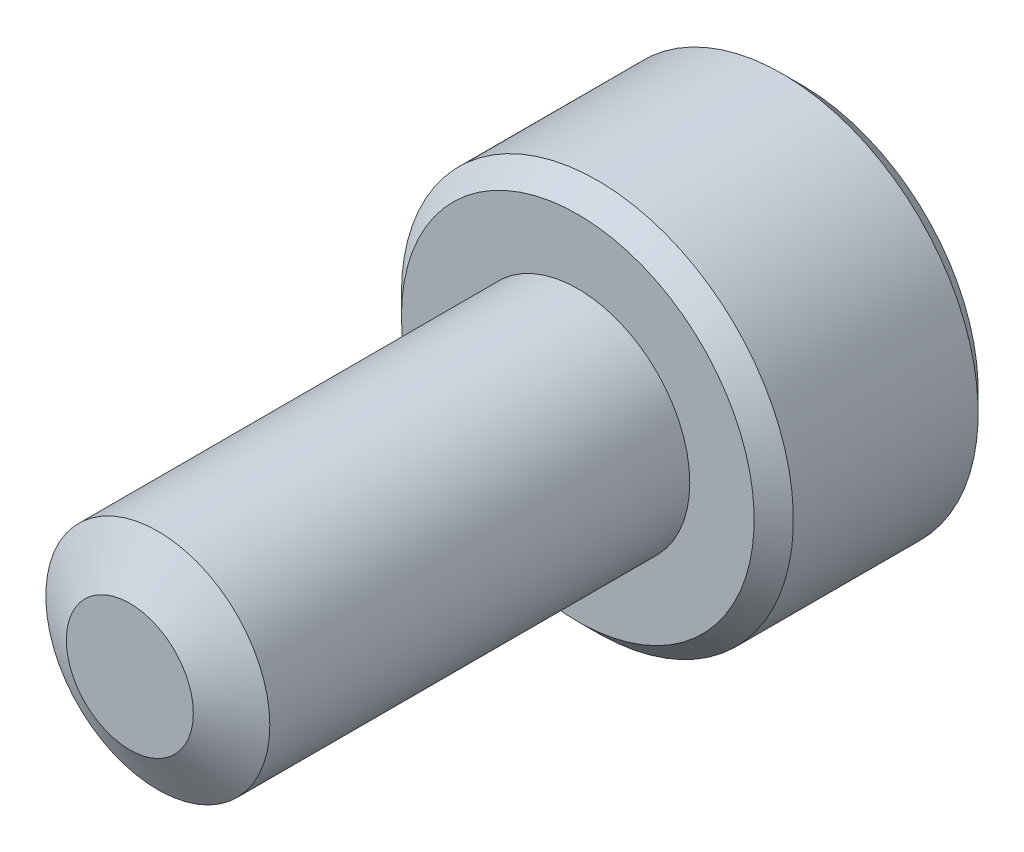
ISO-10303-21;
HEADER;
FILE_DESCRIPTION(('STEP AP214'),'2;1');
FILE_NAME('part.step','',(''),(''),'','','');
FILE_SCHEMA(('AUTOMOTIVE_DESIGN { 1 0 10303 214 1 1 1 1 }'));
ENDSEC;
DATA;
#1=APPLICATION_CONTEXT('core data for automotive mechanical design processes');
#2=APPLICATION_PROTOCOL_DEFINITION('international standard','automotive_design',2000,#1);
#3=PRODUCT_CONTEXT('',#1,'mechanical');
#4=PRODUCT('Part','Part','',(#3));
#5=PRODUCT_RELATED_PRODUCT_CATEGORY('part','',(#4));
#6=PRODUCT_DEFINITION_FORMATION('','',#4);
#7=PRODUCT_DEFINITION_CONTEXT('part definition',#1,'design');
#8=PRODUCT_DEFINITION('design','',#6,#7);
#9=PRODUCT_DEFINITION_SHAPE('','',#8);
#10=(LENGTH_UNIT() NAMED_UNIT(*) SI_UNIT(.MILLI.,.METRE.));
#11=(NAMED_UNIT(*) PLANE_ANGLE_UNIT() SI_UNIT($,.RADIAN.));
#12=(NAMED_UNIT(*) SI_UNIT($,.STERADIAN.) SOLID_ANGLE_UNIT());
#13=UNCERTAINTY_MEASURE_WITH_UNIT(LENGTH_MEASURE(1.E-05),#10,'distance_accuracy_value','');
#14=(GEOMETRIC_REPRESENTATION_CONTEXT(3) GLOBAL_UNCERTAINTY_ASSIGNED_CONTEXT((#13)) GLOBAL_UNIT_ASSIGNED_CONTEXT((#10,
#11,#12)) REPRESENTATION_CONTEXT('',''));
#15=CARTESIAN_POINT('',(0.,0.,0.));
#16=DIRECTION('',(0.,0.,1.));
#17=DIRECTION('',(1.,0.,0.));
#18=AXIS2_PLACEMENT_3D('',#15,#16,#17);
#19=CARTESIAN_POINT('',(0.,0.,-8.));
#20=DIRECTION('',(0.,0.,1.));
#21=DIRECTION('',(1.,0.,0.));
#22=AXIS2_PLACEMENT_3D('',#19,#20,#21);
#23=CYLINDRICAL_SURFACE('',#22,2.);
#24=CARTESIAN_POINT('',(0.,0.,-0.500000000000003));
#25=DIRECTION('',(0.,0.,1.));
#26=DIRECTION('',(1.,0.,0.));
#27=AXIS2_PLACEMENT_3D('',#24,#25,#26);
#28=CIRCLE('',#27,2.);
#29=CARTESIAN_POINT('',(2.,0.,-0.500000000000003));
#30=VERTEX_POINT('',#29);
#31=EDGE_CURVE('E11',#30,#30,#28,.F.);
#32=ORIENTED_EDGE('',*,*,#31,.T.);
#33=EDGE_LOOP('',(#32));
#34=FACE_BOUND('',#33,.T.);
#35=CARTESIAN_POINT('',(0.,0.,-8.));
#36=DIRECTION('',(0.,0.,1.));
#37=DIRECTION('',(1.,0.,0.));
#38=AXIS2_PLACEMENT_3D('',#35,#36,#37);
#39=CIRCLE('',#38,2.);
#40=CARTESIAN_POINT('',(2.,0.,-8.));
#41=VERTEX_POINT('',#40);
#42=EDGE_CURVE('E116',#41,#41,#39,.T.);
#43=ORIENTED_EDGE('',*,*,#42,.T.);
#44=EDGE_LOOP('',(#43));
#45=FACE_BOUND('',#44,.T.);
#46=ADVANCED_FACE('F39',(#34,#45),#23,.T.);
#47=CARTESIAN_POINT('',(0.,0.,-12.));
#48=DIRECTION('',(0.,0.,1.));
#49=DIRECTION('',(1.,0.,0.));
#50=AXIS2_PLACEMENT_3D('',#47,#48,#49);
#51=CYLINDRICAL_SURFACE('',#50,3.5);
#52=CARTESIAN_POINT('',(0.,0.,-11.65));
#53=DIRECTION('',(0.,0.,-1.));
#54=DIRECTION('',(-1.,0.,0.));
#55=AXIS2_PLACEMENT_3D('',#52,#53,#54);
#56=CIRCLE('',#55,3.5);
#57=CARTESIAN_POINT('',(-3.5,0.,-11.65));
#58=VERTEX_POINT('',#57);
#59=EDGE_CURVE('E188',#58,#58,#56,.F.);
#60=ORIENTED_EDGE('',*,*,#59,.T.);
#61=EDGE_LOOP('',(#60));
#62=FACE_BOUND('',#61,.T.);
#63=CARTESIAN_POINT('',(0.,0.,-8.35));
#64=DIRECTION('',(0.,0.,-1.));
#65=DIRECTION('',(-1.,0.,0.));
#66=AXIS2_PLACEMENT_3D('',#63,#64,#65);
#67=CIRCLE('',#66,3.5);
#68=CARTESIAN_POINT('',(-3.5,0.,-8.35));
#69=VERTEX_POINT('',#68);
#70=EDGE_CURVE('E184',#69,#69,#67,.T.);
#71=ORIENTED_EDGE('',*,*,#70,.T.);
#72=EDGE_LOOP('',(#71));
#73=FACE_BOUND('',#72,.T.);
#74=ADVANCED_FACE('F210',(#62,#73),#51,.T.);
#75=CARTESIAN_POINT('',(0.,0.,-12.));
#76=DIRECTION('',(0.,0.,-1.));
#77=DIRECTION('',(-1.,0.,0.));
#78=AXIS2_PLACEMENT_3D('',#75,#76,#77);
#79=PLANE('',#78);
#80=CARTESIAN_POINT('',(0.,0.,-12.));
#81=DIRECTION('',(0.,0.,-1.));
#82=DIRECTION('',(-1.,0.,0.));
#83=AXIS2_PLACEMENT_3D('',#80,#81,#82);
#84=CIRCLE('',#83,3.15);
#85=CARTESIAN_POINT('',(-3.15,0.,-12.));
#86=VERTEX_POINT('',#85);
#87=EDGE_CURVE('E115',#86,#86,#84,.T.);
#88=ORIENTED_EDGE('',*,*,#87,.T.);
#89=EDGE_LOOP('',(#88));
#90=FACE_BOUND('',#89,.T.);
#91=CARTESIAN_POINT('',(0.,0.,-12.));
#92=DIRECTION('',(0.,0.,-1.));
#93=DIRECTION('',(-1.,0.,0.));
#94=AXIS2_PLACEMENT_3D('',#91,#92,#93);
#95=CIRCLE('',#94,1.73205080756888);
#96=CARTESIAN_POINT('',(-1.5,0.866025403784441,-12.));
#97=VERTEX_POINT('',#96);
#98=CARTESIAN_POINT('',(0.,1.73205080756888,-12.));
#99=VERTEX_POINT('',#98);
#100=EDGE_CURVE('E94',#97,#99,#95,.T.);
#101=ORIENTED_EDGE('',*,*,#100,.F.);
#102=CARTESIAN_POINT('',(-1.5,-0.86602540378444,-12.));
#103=VERTEX_POINT('',#102);
#104=EDGE_CURVE('E54',#103,#97,#95,.T.);
#105=ORIENTED_EDGE('',*,*,#104,.F.);
#106=CARTESIAN_POINT('',(0.,-1.73205080756888,-12.));
#107=VERTEX_POINT('',#106);
#108=EDGE_CURVE('E311',#107,#103,#95,.T.);
#109=ORIENTED_EDGE('',*,*,#108,.F.);
#110=CARTESIAN_POINT('',(1.5,-0.86602540378444,-12.));
#111=VERTEX_POINT('',#110);
#112=EDGE_CURVE('E61',#111,#107,#95,.T.);
#113=ORIENTED_EDGE('',*,*,#112,.F.);
#114=CARTESIAN_POINT('',(1.5,0.866025403784441,-12.));
#115=VERTEX_POINT('',#114);
#116=EDGE_CURVE('E139',#115,#111,#95,.T.);
#117=ORIENTED_EDGE('',*,*,#116,.F.);
#118=EDGE_CURVE('E104',#99,#115,#95,.T.);
#119=ORIENTED_EDGE('',*,*,#118,.F.);
#120=EDGE_LOOP('',(#101,#105,#109,#113,#117,#119));
#121=FACE_BOUND('',#120,.T.);
#122=ADVANCED_FACE('F138',(#90,#121),#79,.T.);
#123=CARTESIAN_POINT('',(0.,0.,-8.));
#124=DIRECTION('',(0.,0.,-1.));
#125=DIRECTION('',(-1.,0.,0.));
#126=AXIS2_PLACEMENT_3D('',#123,#124,#125);
#127=PLANE('',#126);
#128=CARTESIAN_POINT('',(0.,0.,-8.));
#129=DIRECTION('',(0.,0.,-1.));
#130=DIRECTION('',(-1.,0.,0.));
#131=AXIS2_PLACEMENT_3D('',#128,#129,#130);
#132=CIRCLE('',#131,3.15);
#133=CARTESIAN_POINT('',(-3.15,0.,-8.));
#134=VERTEX_POINT('',#133);
#135=EDGE_CURVE('E192',#134,#134,#132,.F.);
#136=ORIENTED_EDGE('',*,*,#135,.T.);
#137=EDGE_LOOP('',(#136));
#138=FACE_BOUND('',#137,.T.);
#139=ORIENTED_EDGE('',*,*,#42,.F.);
#140=EDGE_LOOP('',(#139));
#141=FACE_BOUND('',#140,.T.);
#142=ADVANCED_FACE('F232',(#138,#141),#127,.F.);
#143=CARTESIAN_POINT('',(0.,0.,-12.));
#144=DIRECTION('',(0.,0.,-1.));
#145=DIRECTION('',(-1.,0.,0.));
#146=AXIS2_PLACEMENT_3D('',#143,#144,#145);
#147=CONICAL_SURFACE('',#146,1.73205080756888,0.78539816339745);
#148=ORIENTED_EDGE('',*,*,#118,.T.);
#149=CARTESIAN_POINT('',(-0.000199999999999824,1.73216627762272,-12.0001154816001));
#150=CARTESIAN_POINT('',(0.0513677907370759,1.70239359975915,-11.9703654760673));
#151=CARTESIAN_POINT('',(0.103797917665201,1.67212305186355,-11.9423624839103));
#152=CARTESIAN_POINT('',(0.210709034055597,1.61039789003619,-11.8910892304401));
#153=CARTESIAN_POINT('',(0.265200195814661,1.57893740312614,-11.8678475050444));
#154=CARTESIAN_POINT('',(0.375079081357248,1.51549879897987,-11.8280337289922));
#155=CARTESIAN_POINT('',(0.430438809095199,1.4835368452681,-11.8113615856709));
#156=CARTESIAN_POINT('',(0.54237725747715,1.41890915196211,-11.7856744568181));
#157=CARTESIAN_POINT('',(0.598952556553009,1.38624538781118,-11.7766402904789));
#158=CARTESIAN_POINT('',(0.696455389516441,1.329952100953,-11.7684890812269));
#159=CARTESIAN_POINT('',(0.737256908280466,1.30639533311124,-11.7672822529892));
#160=CARTESIAN_POINT('',(0.818787969615858,1.25932335290193,-11.7693140571623));
#161=CARTESIAN_POINT('',(0.85951749431463,1.23580815085313,-11.7725536707483));
#162=CARTESIAN_POINT('',(0.940584402163416,1.18900414978427,-11.783291985982));
#163=CARTESIAN_POINT('',(0.980921384598288,1.1657155821172,-11.7907946530187));
#164=CARTESIAN_POINT('',(1.06091833691403,1.11952932016335,-11.8096516119283));
#165=CARTESIAN_POINT('',(1.10057800851621,1.09663179808786,-11.8210075570186));
#166=CARTESIAN_POINT('',(1.20216313477448,1.03798159809699,-11.8547216475927));
#167=CARTESIAN_POINT('',(1.26345855370969,1.00259267147465,-11.8796218490934));
#168=CARTESIAN_POINT('',(1.35358562846331,0.950557780604376,-11.9216566532716));
#169=CARTESIAN_POINT('',(1.38328513990772,0.933410759677149,-11.9364251535591));
#170=CARTESIAN_POINT('',(1.44213790138375,0.899432101996408,-11.9673105659402));
#171=CARTESIAN_POINT('',(1.47129140422064,0.882600319285711,-11.9834268341217));
#172=CARTESIAN_POINT('',(1.5002,0.865909933730602,-12.0001154816001));
#173=B_SPLINE_CURVE_WITH_KNOTS('',3,(#149,#150,#151,#152,#153,#154,#155,#156,#157,#158,#159,
#160,#161,#162,#163,#164,#165,#166,#167,#168,#169,#170,#171,#172),.UNSPECIFIED.,.F.,.F.,(4,2,2,
2,2,2,2,2,2,2,2,4),(0.,0.199829143693304,0.400822987382389,0.59862372053818,0.795926240188889,
0.937113067959881,1.07833105577193,1.21968061668222,1.36109089931054,1.58570969637565,
1.69770705470963,1.80965120737193),.UNSPECIFIED.);
#174=EDGE_CURVE('E109',#99,#115,#173,.T.);
#175=ORIENTED_EDGE('',*,*,#174,.F.);
#176=EDGE_LOOP('',(#148,#175));
#177=FACE_BOUND('',#176,.T.);
#178=ADVANCED_FACE('F110',(#177),#147,.F.);
#179=ORIENTED_EDGE('',*,*,#116,.T.);
#180=CARTESIAN_POINT('',(1.5,-1.72720812994822,-12.5555785164605));
#181=CARTESIAN_POINT('',(1.5,-1.68515175723693,-12.5238299080399));
#182=CARTESIAN_POINT('',(1.5,-1.64286104772391,-12.4923925939825));
#183=CARTESIAN_POINT('',(1.5,-1.55771581058238,-12.430269087717));
#184=CARTESIAN_POINT('',(1.5,-1.51486114408249,-12.3995830860455));
#185=CARTESIAN_POINT('',(1.5,-1.38468134170665,-12.3084071925586));
#186=CARTESIAN_POINT('',(1.5,-1.29637976089561,-12.2492883435437));
#187=CARTESIAN_POINT('',(1.5,-1.11121478745132,-12.1332309964035));
#188=CARTESIAN_POINT('',(1.5,-1.01415038251068,-12.0766095588047));
#189=CARTESIAN_POINT('',(1.5,-0.815173408989815,-11.9730368813091));
#190=CARTESIAN_POINT('',(1.5,-0.713278669326361,-11.9260530415721));
#191=CARTESIAN_POINT('',(1.5,-0.560333775001791,-11.8685726684515));
#192=CARTESIAN_POINT('',(1.5,-0.51154798301275,-11.8520753877783));
#193=CARTESIAN_POINT('',(1.5,-0.41279862021383,-11.8229975129476));
#194=CARTESIAN_POINT('',(1.5,-0.362834968520752,-11.8104171886138));
#195=CARTESIAN_POINT('',(1.5,-0.262863235540418,-11.7900361941635));
#196=CARTESIAN_POINT('',(1.5,-0.212872113909477,-11.7821536327604));
#197=CARTESIAN_POINT('',(1.5,-0.112355243682833,-11.7713220639777));
#198=CARTESIAN_POINT('',(1.5,-0.0618295884917324,-11.7683722085294));
#199=CARTESIAN_POINT('',(1.5,0.037429173202548,-11.7676248577218));
#200=CARTESIAN_POINT('',(1.5,0.0861609670655325,-11.7696447335505));
#201=CARTESIAN_POINT('',(1.5,0.183206937624693,-11.7783225528794));
#202=CARTESIAN_POINT('',(1.5,0.231521073289699,-11.7849809469459));
#203=CARTESIAN_POINT('',(1.5,0.328199853268107,-11.802685244089));
#204=CARTESIAN_POINT('',(1.5,0.37655061614869,-11.8138058112177));
#205=CARTESIAN_POINT('',(1.5,0.472195696955758,-11.8398434139978));
#206=CARTESIAN_POINT('',(1.5,0.519490102919008,-11.8547601319841));
#207=CARTESIAN_POINT('',(1.5,0.668391282485062,-11.9073352235115));
#208=CARTESIAN_POINT('',(1.5,0.767878709264949,-11.9509812873618));
#209=CARTESIAN_POINT('',(1.5,0.962179866385498,-12.0480229944291));
#210=CARTESIAN_POINT('',(1.5,1.05697519927965,-12.1014536648971));
#211=CARTESIAN_POINT('',(1.5,1.23814273494588,-12.2116858517578));
#212=CARTESIAN_POINT('',(1.5,1.32469942140117,-12.2681879204262));
#213=CARTESIAN_POINT('',(1.5,1.45222331245984,-12.3555343012678));
#214=CARTESIAN_POINT('',(1.5,1.49418091932912,-12.3849577583565));
#215=CARTESIAN_POINT('',(1.5,1.5775227288333,-12.4445828214816));
#216=CARTESIAN_POINT('',(1.5,1.6189070859806,-12.4747842113029));
#217=CARTESIAN_POINT('',(1.5,1.66005277969054,-12.5053081782352));
#218=B_SPLINE_CURVE_WITH_KNOTS('',3,(#180,#181,#182,#183,#184,#185,#186,#187,#188,#189,#190,
#191,#192,#193,#194,#195,#196,#197,#198,#199,#200,#201,#202,#203,#204,#205,#206,#207,#208,#209,
#210,#211,#212,#213,#214,#215,#216,#217),.UNSPECIFIED.,.F.,.F.,(4,2,2,2,2,2,2,2,2,2,2,2,2,2,2,2,
2,2,4),(0.,0.158079549012758,0.316198781054129,0.634850417468464,0.971690311551781,
1.30737131686505,1.46173961151183,1.61611853763032,1.76772101442095,1.91929742387554,
2.06538741227088,2.21149159321503,2.36014984648185,2.50879566399376,2.83376031423511,
3.15991186974582,3.4698560178094,3.62358896013692,3.77727962610764),.UNSPECIFIED.);
#219=EDGE_CURVE('E103',#115,#111,#218,.F.);
#220=ORIENTED_EDGE('',*,*,#219,.F.);
#221=EDGE_LOOP('',(#179,#220));
#222=FACE_BOUND('',#221,.T.);
#223=ADVANCED_FACE('F320',(#222),#147,.F.);
#224=ORIENTED_EDGE('',*,*,#112,.T.);
#225=CARTESIAN_POINT('',(1.5002,-0.865909933730601,-12.0001154816001));
#226=CARTESIAN_POINT('',(1.44863220926292,-0.895682611594165,-11.9703654760673));
#227=CARTESIAN_POINT('',(1.3962020823348,-0.925953159489765,-11.9423624839103));
#228=CARTESIAN_POINT('',(1.2892909659444,-0.987678321317123,-11.8910892304401));
#229=CARTESIAN_POINT('',(1.23479980418534,-1.01913880822717,-11.8678475050444));
#230=CARTESIAN_POINT('',(1.12492091864275,-1.08257741237344,-11.8280337289922));
#231=CARTESIAN_POINT('',(1.0695611909048,-1.11453936608521,-11.8113615856709));
#232=CARTESIAN_POINT('',(0.957622742522849,-1.1791670593912,-11.7856744568181));
#233=CARTESIAN_POINT('',(0.901047443446991,-1.21183082354213,-11.7766402904789));
#234=CARTESIAN_POINT('',(0.803544610483559,-1.26812411040032,-11.7684890812268));
#235=CARTESIAN_POINT('',(0.762743091719533,-1.29168087824208,-11.7672822529892));
#236=CARTESIAN_POINT('',(0.681212030384141,-1.33875285845138,-11.7693140571623));
#237=CARTESIAN_POINT('',(0.64048250568537,-1.36226806050018,-11.7725536707483));
#238=CARTESIAN_POINT('',(0.559415597836583,-1.40907206156905,-11.783291985982));
#239=CARTESIAN_POINT('',(0.519078615401711,-1.43236062923612,-11.7907946530187));
#240=CARTESIAN_POINT('',(0.439081663085969,-1.47854689118996,-11.8096516119283));
#241=CARTESIAN_POINT('',(0.399421991483792,-1.50144441326545,-11.8210075570186));
#242=CARTESIAN_POINT('',(0.297836865225515,-1.56009461325633,-11.8547216475927));
#243=CARTESIAN_POINT('',(0.236541446290311,-1.59548353987866,-11.8796218490934));
#244=CARTESIAN_POINT('',(0.146414371536686,-1.64751843074894,-11.9216566532716));
#245=CARTESIAN_POINT('',(0.116714860092282,-1.66466545167617,-11.9364251535591));
#246=CARTESIAN_POINT('',(0.0578620986162485,-1.69864410935691,-11.9673105659402));
#247=CARTESIAN_POINT('',(0.0287085957793623,-1.71547589206761,-11.9834268341217));
#248=CARTESIAN_POINT('',(-0.000200000000000303,-1.73216627762271,-12.0001154816001));
#249=B_SPLINE_CURVE_WITH_KNOTS('',3,(#225,#226,#227,#228,#229,#230,#231,#232,#233,#234,#235,
#236,#237,#238,#239,#240,#241,#242,#243,#244,#245,#246,#247,#248),.UNSPECIFIED.,.F.,.F.,(4,2,2,
2,2,2,2,2,2,2,2,4),(0.,0.199829143693304,0.400822987382389,0.598623720538181,0.795926240188889,
0.937113067959881,1.07833105577193,1.21968061668222,1.36109089931054,1.58570969637565,
1.69770705470964,1.80965120737194),.UNSPECIFIED.);
#250=EDGE_CURVE('E152',#111,#107,#249,.T.);
#251=ORIENTED_EDGE('',*,*,#250,.F.);
#252=EDGE_LOOP('',(#224,#251));
#253=FACE_BOUND('',#252,.T.);
#254=ADVANCED_FACE('F318',(#253),#147,.F.);
#255=ORIENTED_EDGE('',*,*,#108,.T.);
#256=CARTESIAN_POINT('',(0.000199999999999393,-1.73216627762271,-12.0001154816001));
#257=CARTESIAN_POINT('',(-0.0513677907370765,-1.70239359975915,-11.9703654760673));
#258=CARTESIAN_POINT('',(-0.103797917665202,-1.67212305186355,-11.9423624839103));
#259=CARTESIAN_POINT('',(-0.210709034055598,-1.61039789003619,-11.8910892304401));
#260=CARTESIAN_POINT('',(-0.265200195814662,-1.57893740312614,-11.8678475050444));
#261=CARTESIAN_POINT('',(-0.37507908135725,-1.51549879897987,-11.8280337289922));
#262=CARTESIAN_POINT('',(-0.430438809095201,-1.4835368452681,-11.8113615856709));
#263=CARTESIAN_POINT('',(-0.542377257477152,-1.41890915196211,-11.7856744568181));
#264=CARTESIAN_POINT('',(-0.59895255655301,-1.38624538781118,-11.7766402904789));
#265=CARTESIAN_POINT('',(-0.696455389516442,-1.32995210095299,-11.7684890812269));
#266=CARTESIAN_POINT('',(-0.737256908280467,-1.30639533311124,-11.7672822529892));
#267=CARTESIAN_POINT('',(-0.818787969615859,-1.25932335290193,-11.7693140571623));
#268=CARTESIAN_POINT('',(-0.859517494314631,-1.23580815085313,-11.7725536707483));
#269=CARTESIAN_POINT('',(-0.940584402163417,-1.18900414978427,-11.783291985982));
#270=CARTESIAN_POINT('',(-0.980921384598289,-1.16571558211719,-11.7907946530187));
#271=CARTESIAN_POINT('',(-1.06091833691403,-1.11952932016335,-11.8096516119283));
#272=CARTESIAN_POINT('',(-1.10057800851621,-1.09663179808786,-11.8210075570186));
#273=CARTESIAN_POINT('',(-1.20216313477449,-1.03798159809698,-11.8547216475927));
#274=CARTESIAN_POINT('',(-1.26345855370969,-1.00259267147465,-11.8796218490934));
#275=CARTESIAN_POINT('',(-1.35358562846331,-0.950557780604375,-11.9216566532716));
#276=CARTESIAN_POINT('',(-1.38328513990772,-0.933410759677148,-11.9364251535591));
#277=CARTESIAN_POINT('',(-1.44213790138375,-0.899432101996407,-11.9673105659402));
#278=CARTESIAN_POINT('',(-1.47129140422064,-0.882600319285711,-11.9834268341217));
#279=CARTESIAN_POINT('',(-1.5002,-0.865909933730602,-12.0001154816001));
#280=B_SPLINE_CURVE_WITH_KNOTS('',3,(#256,#257,#258,#259,#260,#261,#262,#263,#264,#265,#266,
#267,#268,#269,#270,#271,#272,#273,#274,#275,#276,#277,#278,#279),.UNSPECIFIED.,.F.,.F.,(4,2,2,
2,2,2,2,2,2,2,2,4),(0.,0.199829143693306,0.400822987382389,0.598623720538181,0.79592624018889,
0.937113067959881,1.07833105577193,1.21968061668222,1.36109089931054,1.58570969637565,
1.69770705470963,1.80965120737193),.UNSPECIFIED.);
#281=EDGE_CURVE('E283',#107,#103,#280,.T.);
#282=ORIENTED_EDGE('',*,*,#281,.F.);
#283=EDGE_LOOP('',(#255,#282));
#284=FACE_BOUND('',#283,.T.);
#285=ADVANCED_FACE('F316',(#284),#147,.F.);
#286=ORIENTED_EDGE('',*,*,#104,.T.);
#287=CARTESIAN_POINT('',(-1.5,-1.72720812994823,-12.5555785164605));
#288=CARTESIAN_POINT('',(-1.5,-1.68515175723693,-12.5238299080399));
#289=CARTESIAN_POINT('',(-1.5,-1.64286104772391,-12.4923925939825));
#290=CARTESIAN_POINT('',(-1.5,-1.55771581058238,-12.430269087717));
#291=CARTESIAN_POINT('',(-1.5,-1.5148611440825,-12.3995830860455));
#292=CARTESIAN_POINT('',(-1.5,-1.38468134170665,-12.3084071925586));
#293=CARTESIAN_POINT('',(-1.5,-1.29637976089562,-12.2492883435437));
#294=CARTESIAN_POINT('',(-1.5,-1.11121478745132,-12.1332309964035));
#295=CARTESIAN_POINT('',(-1.5,-1.01415038251068,-12.0766095588047));
#296=CARTESIAN_POINT('',(-1.5,-0.815173408989817,-11.9730368813091));
#297=CARTESIAN_POINT('',(-1.5,-0.713278669326362,-11.9260530415721));
#298=CARTESIAN_POINT('',(-1.5,-0.560333775001792,-11.8685726684515));
#299=CARTESIAN_POINT('',(-1.5,-0.511547983012751,-11.8520753877783));
#300=CARTESIAN_POINT('',(-1.5,-0.412798620213831,-11.8229975129476));
#301=CARTESIAN_POINT('',(-1.5,-0.362834968520753,-11.8104171886138));
#302=CARTESIAN_POINT('',(-1.5,-0.262863235540419,-11.7900361941635));
#303=CARTESIAN_POINT('',(-1.5,-0.212872113909477,-11.7821536327604));
#304=CARTESIAN_POINT('',(-1.5,-0.112355243682834,-11.7713220639777));
#305=CARTESIAN_POINT('',(-1.5,-0.0618295884917324,-11.7683722085294));
#306=CARTESIAN_POINT('',(-1.5,0.0374291732025484,-11.7676248577218));
#307=CARTESIAN_POINT('',(-1.5,0.0861609670655333,-11.7696447335505));
#308=CARTESIAN_POINT('',(-1.5,0.183206937624694,-11.7783225528794));
#309=CARTESIAN_POINT('',(-1.5,0.2315210732897,-11.7849809469459));
#310=CARTESIAN_POINT('',(-1.5,0.328199853268108,-11.802685244089));
#311=CARTESIAN_POINT('',(-1.5,0.376550616148691,-11.8138058112177));
#312=CARTESIAN_POINT('',(-1.5,0.47219569695576,-11.8398434139978));
#313=CARTESIAN_POINT('',(-1.5,0.519490102919009,-11.8547601319841));
#314=CARTESIAN_POINT('',(-1.5,0.668391282485063,-11.9073352235115));
#315=CARTESIAN_POINT('',(-1.5,0.76787870926495,-11.9509812873618));
#316=CARTESIAN_POINT('',(-1.5,0.962179866385499,-12.0480229944291));
#317=CARTESIAN_POINT('',(-1.5,1.05697519927965,-12.1014536648971));
#318=CARTESIAN_POINT('',(-1.5,1.23814273494588,-12.2116858517578));
#319=CARTESIAN_POINT('',(-1.5,1.32469942140117,-12.2681879204262));
#320=CARTESIAN_POINT('',(-1.5,1.45222331245985,-12.3555343012678));
#321=CARTESIAN_POINT('',(-1.5,1.49418091932912,-12.3849577583565));
#322=CARTESIAN_POINT('',(-1.5,1.5775227288333,-12.4445828214816));
#323=CARTESIAN_POINT('',(-1.5,1.6189070859806,-12.4747842113029));
#324=CARTESIAN_POINT('',(-1.5,1.66005277969054,-12.5053081782352));
#325=B_SPLINE_CURVE_WITH_KNOTS('',3,(#287,#288,#289,#290,#291,#292,#293,#294,#295,#296,#297,
#298,#299,#300,#301,#302,#303,#304,#305,#306,#307,#308,#309,#310,#311,#312,#313,#314,#315,#316,
#317,#318,#319,#320,#321,#322,#323,#324),.UNSPECIFIED.,.F.,.F.,(4,2,2,2,2,2,2,2,2,2,2,2,2,2,2,2,
2,2,4),(0.,0.158079549012758,0.316198781054129,0.634850417468466,0.971690311551782,
1.30737131686505,1.46173961151184,1.61611853763032,1.76772101442095,1.91929742387554,
2.06538741227089,2.21149159321503,2.36014984648185,2.50879566399377,2.83376031423511,
3.15991186974583,3.4698560178094,3.62358896013692,3.77727962610764),.UNSPECIFIED.);
#326=EDGE_CURVE('E127',#103,#97,#325,.T.);
#327=ORIENTED_EDGE('',*,*,#326,.F.);
#328=EDGE_LOOP('',(#286,#327));
#329=FACE_BOUND('',#328,.T.);
#330=ADVANCED_FACE('F325',(#329),#147,.F.);
#331=ORIENTED_EDGE('',*,*,#100,.T.);
#332=CARTESIAN_POINT('',(-1.5002,0.865909933730602,-12.0001154816001));
#333=CARTESIAN_POINT('',(-1.44863220926292,0.895682611594167,-11.9703654760673));
#334=CARTESIAN_POINT('',(-1.3962020823348,0.925953159489766,-11.9423624839103));
#335=CARTESIAN_POINT('',(-1.2892909659444,0.987678321317125,-11.8910892304401));
#336=CARTESIAN_POINT('',(-1.23479980418534,1.01913880822718,-11.8678475050444));
#337=CARTESIAN_POINT('',(-1.12492091864275,1.08257741237344,-11.8280337289922));
#338=CARTESIAN_POINT('',(-1.0695611909048,1.11453936608522,-11.8113615856709));
#339=CARTESIAN_POINT('',(-0.957622742522848,1.1791670593912,-11.7856744568181));
#340=CARTESIAN_POINT('',(-0.90104744344699,1.21183082354213,-11.7766402904789));
#341=CARTESIAN_POINT('',(-0.803544610483557,1.26812411040032,-11.7684890812269));
#342=CARTESIAN_POINT('',(-0.762743091719532,1.29168087824208,-11.7672822529892));
#343=CARTESIAN_POINT('',(-0.68121203038414,1.33875285845138,-11.7693140571623));
#344=CARTESIAN_POINT('',(-0.640482505685368,1.36226806050018,-11.7725536707483));
#345=CARTESIAN_POINT('',(-0.559415597836582,1.40907206156905,-11.783291985982));
#346=CARTESIAN_POINT('',(-0.51907861540171,1.43236062923612,-11.7907946530187));
#347=CARTESIAN_POINT('',(-0.439081663085967,1.47854689118997,-11.8096516119283));
#348=CARTESIAN_POINT('',(-0.39942199148379,1.50144441326545,-11.8210075570186));
#349=CARTESIAN_POINT('',(-0.297836865225513,1.56009461325633,-11.8547216475927));
#350=CARTESIAN_POINT('',(-0.23654144629031,1.59548353987866,-11.8796218490934));
#351=CARTESIAN_POINT('',(-0.146414371536686,1.64751843074894,-11.9216566532716));
#352=CARTESIAN_POINT('',(-0.116714860092282,1.66466545167617,-11.9364251535591));
#353=CARTESIAN_POINT('',(-0.0578620986162488,1.69864410935691,-11.9673105659402));
#354=CARTESIAN_POINT('',(-0.0287085957793628,1.71547589206761,-11.9834268341217));
#355=CARTESIAN_POINT('',(0.00019999999999983,1.73216627762271,-12.0001154816001));
#356=B_SPLINE_CURVE_WITH_KNOTS('',3,(#332,#333,#334,#335,#336,#337,#338,#339,#340,#341,#342,
#343,#344,#345,#346,#347,#348,#349,#350,#351,#352,#353,#354,#355),.UNSPECIFIED.,.F.,.F.,(4,2,2,
2,2,2,2,2,2,2,2,4),(0.,0.199829143693304,0.400822987382388,0.598623720538181,0.795926240188889,
0.937113067959881,1.07833105577193,1.21968061668222,1.36109089931054,1.58570969637565,
1.69770705470963,1.80965120737193),.UNSPECIFIED.);
#357=EDGE_CURVE('E98',#97,#99,#356,.T.);
#358=ORIENTED_EDGE('',*,*,#357,.F.);
#359=EDGE_LOOP('',(#331,#358));
#360=FACE_BOUND('',#359,.T.);
#361=ADVANCED_FACE('F96',(#360),#147,.F.);
#362=CARTESIAN_POINT('',(1.5,2.59807621135331,-9.75));
#363=DIRECTION('',(0.,0.,-1.));
#364=DIRECTION('',(-1.,0.,0.));
#365=AXIS2_PLACEMENT_3D('',#362,#363,#364);
#366=PLANE('',#365);
#367=DIRECTION('',(0.866025403784439,0.5,0.));
#368=VECTOR('',#367,1.);
#369=CARTESIAN_POINT('',(-1.5,0.86602540378444,-9.75));
#370=LINE('',#369,#368);
#371=CARTESIAN_POINT('',(-1.5,0.86602540378444,-9.75));
#372=VERTEX_POINT('',#371);
#373=CARTESIAN_POINT('',(0.,1.73205080756888,-9.75));
#374=VERTEX_POINT('',#373);
#375=EDGE_CURVE('E126',#372,#374,#370,.T.);
#376=ORIENTED_EDGE('',*,*,#375,.T.);
#377=DIRECTION('',(0.866025403784439,-0.5,0.));
#378=VECTOR('',#377,1.);
#379=CARTESIAN_POINT('',(0.,1.73205080756888,-9.75));
#380=LINE('',#379,#378);
#381=CARTESIAN_POINT('',(1.5,0.86602540378444,-9.75));
#382=VERTEX_POINT('',#381);
#383=EDGE_CURVE('E131',#374,#382,#380,.T.);
#384=ORIENTED_EDGE('',*,*,#383,.T.);
#385=DIRECTION('',(0.,-1.,0.));
#386=VECTOR('',#385,1.);
#387=CARTESIAN_POINT('',(1.5,0.86602540378444,-9.75));
#388=LINE('',#387,#386);
#389=CARTESIAN_POINT('',(1.5,-0.866025403784438,-9.75));
#390=VERTEX_POINT('',#389);
#391=EDGE_CURVE('E258',#382,#390,#388,.T.);
#392=ORIENTED_EDGE('',*,*,#391,.T.);
#393=DIRECTION('',(-0.866025403784439,-0.5,0.));
#394=VECTOR('',#393,1.);
#395=CARTESIAN_POINT('',(1.5,-0.866025403784438,-9.75));
#396=LINE('',#395,#394);
#397=CARTESIAN_POINT('',(0.,-1.73205080756888,-9.75));
#398=VERTEX_POINT('',#397);
#399=EDGE_CURVE('E263',#390,#398,#396,.T.);
#400=ORIENTED_EDGE('',*,*,#399,.T.);
#401=DIRECTION('',(-0.866025403784439,0.5,0.));
#402=VECTOR('',#401,1.);
#403=CARTESIAN_POINT('',(0.,-1.73205080756888,-9.75));
#404=LINE('',#403,#402);
#405=CARTESIAN_POINT('',(-1.5,-0.86602540378444,-9.75));
#406=VERTEX_POINT('',#405);
#407=EDGE_CURVE('E272',#398,#406,#404,.T.);
#408=ORIENTED_EDGE('',*,*,#407,.T.);
#409=DIRECTION('',(0.,1.,0.));
#410=VECTOR('',#409,1.);
#411=CARTESIAN_POINT('',(-1.5,-0.86602540378444,-9.75));
#412=LINE('',#411,#410);
#413=EDGE_CURVE('E135',#406,#372,#412,.T.);
#414=ORIENTED_EDGE('',*,*,#413,.T.);
#415=EDGE_LOOP('',(#376,#384,#392,#400,#408,#414));
#416=FACE_BOUND('',#415,.T.);
#417=ADVANCED_FACE('F172',(#416),#366,.T.);
#418=CARTESIAN_POINT('',(0.,1.73205080756888,-9.75));
#419=DIRECTION('',(0.5,0.866025403784439,0.));
#420=DIRECTION('',(-0.866025403784439,0.5,0.));
#421=AXIS2_PLACEMENT_3D('',#418,#419,#420);
#422=PLANE('',#421);
#423=DIRECTION('',(0.,0.,-1.));
#424=VECTOR('',#423,1.);
#425=CARTESIAN_POINT('',(0.,1.73205080756888,-9.75));
#426=LINE('',#425,#424);
#427=EDGE_CURVE('E122',#374,#99,#426,.T.);
#428=ORIENTED_EDGE('',*,*,#427,.T.);
#429=ORIENTED_EDGE('',*,*,#174,.T.);
#430=DIRECTION('',(0.,0.,-1.));
#431=VECTOR('',#430,1.);
#432=CARTESIAN_POINT('',(1.5,0.86602540378444,-9.75));
#433=LINE('',#432,#431);
#434=EDGE_CURVE('E134',#382,#115,#433,.T.);
#435=ORIENTED_EDGE('',*,*,#434,.F.);
#436=ORIENTED_EDGE('',*,*,#383,.F.);
#437=EDGE_LOOP('',(#428,#429,#435,#436));
#438=FACE_BOUND('',#437,.T.);
#439=ADVANCED_FACE('F129',(#438),#422,.F.);
#440=CARTESIAN_POINT('',(1.5,0.86602540378444,-9.75));
#441=DIRECTION('',(1.,0.,0.));
#442=DIRECTION('',(0.,1.,0.));
#443=AXIS2_PLACEMENT_3D('',#440,#441,#442);
#444=PLANE('',#443);
#445=ORIENTED_EDGE('',*,*,#434,.T.);
#446=ORIENTED_EDGE('',*,*,#219,.T.);
#447=DIRECTION('',(0.,0.,-1.));
#448=VECTOR('',#447,1.);
#449=CARTESIAN_POINT('',(1.5,-0.866025403784438,-9.75));
#450=LINE('',#449,#448);
#451=EDGE_CURVE('E251',#390,#111,#450,.T.);
#452=ORIENTED_EDGE('',*,*,#451,.F.);
#453=ORIENTED_EDGE('',*,*,#391,.F.);
#454=EDGE_LOOP('',(#445,#446,#452,#453));
#455=FACE_BOUND('',#454,.T.);
#456=ADVANCED_FACE('F161',(#455),#444,.F.);
#457=CARTESIAN_POINT('',(1.5,-0.866025403784438,-9.75));
#458=DIRECTION('',(0.5,-0.866025403784439,0.));
#459=DIRECTION('',(0.866025403784439,0.5,0.));
#460=AXIS2_PLACEMENT_3D('',#457,#458,#459);
#461=PLANE('',#460);
#462=ORIENTED_EDGE('',*,*,#451,.T.);
#463=ORIENTED_EDGE('',*,*,#250,.T.);
#464=DIRECTION('',(0.,0.,-1.));
#465=VECTOR('',#464,1.);
#466=CARTESIAN_POINT('',(0.,-1.73205080756888,-9.75));
#467=LINE('',#466,#465);
#468=EDGE_CURVE('E243',#398,#107,#467,.T.);
#469=ORIENTED_EDGE('',*,*,#468,.F.);
#470=ORIENTED_EDGE('',*,*,#399,.F.);
#471=EDGE_LOOP('',(#462,#463,#469,#470));
#472=FACE_BOUND('',#471,.T.);
#473=ADVANCED_FACE('F165',(#472),#461,.F.);
#474=CARTESIAN_POINT('',(0.,-1.73205080756888,-9.75));
#475=DIRECTION('',(-0.5,-0.866025403784439,0.));
#476=DIRECTION('',(0.866025403784439,-0.5,0.));
#477=AXIS2_PLACEMENT_3D('',#474,#475,#476);
#478=PLANE('',#477);
#479=ORIENTED_EDGE('',*,*,#468,.T.);
#480=ORIENTED_EDGE('',*,*,#281,.T.);
#481=DIRECTION('',(0.,0.,-1.));
#482=VECTOR('',#481,1.);
#483=CARTESIAN_POINT('',(-1.5,-0.86602540378444,-9.75));
#484=LINE('',#483,#482);
#485=EDGE_CURVE('E240',#406,#103,#484,.T.);
#486=ORIENTED_EDGE('',*,*,#485,.F.);
#487=ORIENTED_EDGE('',*,*,#407,.F.);
#488=EDGE_LOOP('',(#479,#480,#486,#487));
#489=FACE_BOUND('',#488,.T.);
#490=ADVANCED_FACE('F301',(#489),#478,.F.);
#491=CARTESIAN_POINT('',(-1.5,-0.86602540378444,-9.75));
#492=DIRECTION('',(-1.,0.,0.));
#493=DIRECTION('',(0.,-1.,0.));
#494=AXIS2_PLACEMENT_3D('',#491,#492,#493);
#495=PLANE('',#494);
#496=ORIENTED_EDGE('',*,*,#485,.T.);
#497=ORIENTED_EDGE('',*,*,#326,.T.);
#498=DIRECTION('',(0.,0.,-1.));
#499=VECTOR('',#498,1.);
#500=CARTESIAN_POINT('',(-1.5,0.86602540378444,-9.75));
#501=LINE('',#500,#499);
#502=EDGE_CURVE('E124',#372,#97,#501,.T.);
#503=ORIENTED_EDGE('',*,*,#502,.F.);
#504=ORIENTED_EDGE('',*,*,#413,.F.);
#505=EDGE_LOOP('',(#496,#497,#503,#504));
#506=FACE_BOUND('',#505,.T.);
#507=ADVANCED_FACE('F279',(#506),#495,.F.);
#508=CARTESIAN_POINT('',(-1.5,0.86602540378444,-9.75));
#509=DIRECTION('',(-0.5,0.866025403784439,0.));
#510=DIRECTION('',(-0.866025403784439,-0.5,0.));
#511=AXIS2_PLACEMENT_3D('',#508,#509,#510);
#512=PLANE('',#511);
#513=ORIENTED_EDGE('',*,*,#502,.T.);
#514=ORIENTED_EDGE('',*,*,#357,.T.);
#515=ORIENTED_EDGE('',*,*,#427,.F.);
#516=ORIENTED_EDGE('',*,*,#375,.F.);
#517=EDGE_LOOP('',(#513,#514,#515,#516));
#518=FACE_BOUND('',#517,.T.);
#519=ADVANCED_FACE('F120',(#518),#512,.F.);
#520=CARTESIAN_POINT('',(0.,0.,-12.));
#521=DIRECTION('',(0.,0.,1.));
#522=DIRECTION('',(1.,0.,0.));
#523=AXIS2_PLACEMENT_3D('',#520,#521,#522);
#524=CONICAL_SURFACE('',#523,3.15,0.785398163397445);
#525=ORIENTED_EDGE('',*,*,#59,.F.);
#526=EDGE_LOOP('',(#525));
#527=FACE_BOUND('',#526,.T.);
#528=ORIENTED_EDGE('',*,*,#87,.F.);
#529=EDGE_LOOP('',(#528));
#530=FACE_BOUND('',#529,.T.);
#531=ADVANCED_FACE('F221',(#527,#530),#524,.T.);
#532=CARTESIAN_POINT('',(0.,0.,-8.35));
#533=DIRECTION('',(0.,0.,-1.));
#534=DIRECTION('',(-1.,0.,0.));
#535=AXIS2_PLACEMENT_3D('',#532,#533,#534);
#536=CONICAL_SURFACE('',#535,3.5,0.785398163397451);
#537=CARTESIAN_POINT('',(-3.15,0.,-8.));
#538=CARTESIAN_POINT('',(-3.15364583333333,0.,-8.00364583333333));
#539=CARTESIAN_POINT('',(-3.15729166666666,0.,-8.00729166666667));
#540=CARTESIAN_POINT('',(-3.16458333333333,0.,-8.01458333333333));
#541=CARTESIAN_POINT('',(-3.16822916666666,0.,-8.01822916666667));
#542=CARTESIAN_POINT('',(-3.17552083333333,0.,-8.02552083333333));
#543=CARTESIAN_POINT('',(-3.17916666666666,0.,-8.02916666666667));
#544=CARTESIAN_POINT('',(-3.18645833333333,0.,-8.03645833333333));
#545=CARTESIAN_POINT('',(-3.19010416666666,0.,-8.04010416666667));
#546=CARTESIAN_POINT('',(-3.19739583333333,0.,-8.04739583333333));
#547=CARTESIAN_POINT('',(-3.20104166666666,0.,-8.05104166666667));
#548=CARTESIAN_POINT('',(-3.20833333333333,0.,-8.05833333333333));
#549=CARTESIAN_POINT('',(-3.21197916666666,0.,-8.06197916666667));
#550=CARTESIAN_POINT('',(-3.21927083333333,0.,-8.06927083333333));
#551=CARTESIAN_POINT('',(-3.22291666666666,0.,-8.07291666666667));
#552=CARTESIAN_POINT('',(-3.23020833333333,0.,-8.08020833333333));
#553=CARTESIAN_POINT('',(-3.23385416666666,0.,-8.08385416666667));
#554=CARTESIAN_POINT('',(-3.24114583333333,0.,-8.09114583333333));
#555=CARTESIAN_POINT('',(-3.24479166666666,0.,-8.09479166666667));
#556=CARTESIAN_POINT('',(-3.25208333333333,0.,-8.10208333333333));
#557=CARTESIAN_POINT('',(-3.25572916666666,0.,-8.10572916666667));
#558=CARTESIAN_POINT('',(-3.26302083333333,0.,-8.11302083333333));
#559=CARTESIAN_POINT('',(-3.26666666666666,0.,-8.11666666666667));
#560=CARTESIAN_POINT('',(-3.27395833333333,0.,-8.12395833333333));
#561=CARTESIAN_POINT('',(-3.27760416666666,0.,-8.12760416666667));
#562=CARTESIAN_POINT('',(-3.28489583333333,0.,-8.13489583333333));
#563=CARTESIAN_POINT('',(-3.28854166666666,0.,-8.13854166666667));
#564=CARTESIAN_POINT('',(-3.29583333333333,0.,-8.14583333333333));
#565=CARTESIAN_POINT('',(-3.29947916666667,0.,-8.14947916666667));
#566=CARTESIAN_POINT('',(-3.30677083333333,0.,-8.15677083333333));
#567=CARTESIAN_POINT('',(-3.31041666666666,0.,-8.16041666666667));
#568=CARTESIAN_POINT('',(-3.31770833333333,0.,-8.16770833333333));
#569=CARTESIAN_POINT('',(-3.32135416666666,0.,-8.17135416666667));
#570=CARTESIAN_POINT('',(-3.32864583333333,0.,-8.17864583333333));
#571=CARTESIAN_POINT('',(-3.33229166666666,0.,-8.18229166666667));
#572=CARTESIAN_POINT('',(-3.33958333333333,0.,-8.18958333333333));
#573=CARTESIAN_POINT('',(-3.34322916666666,0.,-8.19322916666667));
#574=CARTESIAN_POINT('',(-3.35052083333333,0.,-8.20052083333333));
#575=CARTESIAN_POINT('',(-3.35416666666667,0.,-8.20416666666667));
#576=CARTESIAN_POINT('',(-3.36145833333333,0.,-8.21145833333333));
#577=CARTESIAN_POINT('',(-3.36510416666667,0.,-8.21510416666667));
#578=CARTESIAN_POINT('',(-3.37239583333333,0.,-8.22239583333333));
#579=CARTESIAN_POINT('',(-3.37604166666667,0.,-8.22604166666667));
#580=CARTESIAN_POINT('',(-3.38333333333333,0.,-8.23333333333333));
#581=CARTESIAN_POINT('',(-3.38697916666667,0.,-8.23697916666667));
#582=CARTESIAN_POINT('',(-3.39427083333333,0.,-8.24427083333333));
#583=CARTESIAN_POINT('',(-3.39791666666667,0.,-8.24791666666667));
#584=CARTESIAN_POINT('',(-3.40520833333333,0.,-8.25520833333333));
#585=CARTESIAN_POINT('',(-3.40885416666667,0.,-8.25885416666667));
#586=CARTESIAN_POINT('',(-3.41614583333333,0.,-8.26614583333333));
#587=CARTESIAN_POINT('',(-3.41979166666667,0.,-8.26979166666667));
#588=CARTESIAN_POINT('',(-3.42708333333333,0.,-8.27708333333333));
#589=CARTESIAN_POINT('',(-3.43072916666667,0.,-8.28072916666667));
#590=CARTESIAN_POINT('',(-3.43802083333333,0.,-8.28802083333333));
#591=CARTESIAN_POINT('',(-3.44166666666667,0.,-8.29166666666667));
#592=CARTESIAN_POINT('',(-3.44895833333333,0.,-8.29895833333333));
#593=CARTESIAN_POINT('',(-3.45260416666667,0.,-8.30260416666667));
#594=CARTESIAN_POINT('',(-3.45989583333333,0.,-8.30989583333333));
#595=CARTESIAN_POINT('',(-3.46354166666667,0.,-8.31354166666667));
#596=CARTESIAN_POINT('',(-3.47083333333333,0.,-8.32083333333333));
#597=CARTESIAN_POINT('',(-3.47447916666667,0.,-8.32447916666667));
#598=CARTESIAN_POINT('',(-3.48177083333333,0.,-8.33177083333333));
#599=CARTESIAN_POINT('',(-3.48541666666667,0.,-8.33541666666667));
#600=CARTESIAN_POINT('',(-3.49270833333333,0.,-8.34270833333333));
#601=CARTESIAN_POINT('',(-3.49635416666667,0.,-8.34635416666667));
#602=CARTESIAN_POINT('',(-3.5,0.,-8.35));
#603=B_SPLINE_CURVE_WITH_KNOTS('',3,(#537,#538,#539,#540,#541,#542,#543,#544,#545,#546,#547,
#548,#549,#550,#551,#552,#553,#554,#555,#556,#557,#558,#559,#560,#561,#562,#563,#564,#565,#566,
#567,#568,#569,#570,#571,#572,#573,#574,#575,#576,#577,#578,#579,#580,#581,#582,#583,#584,#585,
#586,#587,#588,#589,#590,#591,#592,#593,#594,#595,#596,#597,#598,#599,#600,#601,#602),
.UNSPECIFIED.,.F.,.F.,(4,2,2,2,2,2,2,2,2,2,2,2,2,2,2,2,2,2,2,2,2,2,2,2,2,2,2,2,2,2,2,2,4),(0.,
0.0154679608384562,0.0309359216769123,0.0464038825153682,0.0618718433538232,0.0773398041922793,
0.0928077650307355,0.10827572586919,0.123743686707647,0.139211647546103,0.154679608384558,
0.170147569223014,0.18561553006147,0.201083490899925,0.216551451738381,0.232019412576837,
0.247487373415292,0.262955334253748,0.278423295092204,0.293891255930661,0.309359216769115,
0.324827177607572,0.340295138446028,0.355763099284483,0.371231060122939,0.386699020961395,
0.40216698179985,0.417634942638306,0.433102903476762,0.448570864315217,0.464038825153673,
0.479506785992129,0.494974746830586),.UNSPECIFIED.);
#604=EDGE_CURVE('BSEAM206',#134,#69,#603,.T.);
#605=ORIENTED_EDGE('',*,*,#135,.F.);
#606=ORIENTED_EDGE('',*,*,#70,.F.);
#607=ORIENTED_EDGE('',*,*,#604,.T.);
#608=ORIENTED_EDGE('',*,*,#604,.F.);
#609=EDGE_LOOP('',(#605,#607,#606,#608));
#610=FACE_BOUND('',#609,.T.);
#611=ADVANCED_FACE('F206',(#610),#536,.T.);
#612=CARTESIAN_POINT('',(0.,0.,0.));
#613=DIRECTION('',(0.,0.,1.));
#614=DIRECTION('',(1.,0.,0.));
#615=AXIS2_PLACEMENT_3D('',#612,#613,#614);
#616=PLANE('',#615);
#617=CARTESIAN_POINT('',(0.,0.,0.));
#618=DIRECTION('',(0.,0.,1.));
#619=DIRECTION('',(1.,0.,0.));
#620=AXIS2_PLACEMENT_3D('',#617,#618,#619);
#621=CIRCLE('',#620,1.13397459621556);
#622=CARTESIAN_POINT('',(1.13397459621556,0.,0.));
#623=VERTEX_POINT('',#622);
#624=EDGE_CURVE('E48',#623,#623,#621,.T.);
#625=ORIENTED_EDGE('',*,*,#624,.T.);
#626=EDGE_LOOP('',(#625));
#627=FACE_BOUND('',#626,.T.);
#628=ADVANCED_FACE('F199',(#627),#616,.T.);
#629=CARTESIAN_POINT('',(0.,0.,0.));
#630=DIRECTION('',(0.,0.,-1.));
#631=DIRECTION('',(-1.,0.,0.));
#632=AXIS2_PLACEMENT_3D('',#629,#630,#631);
#633=CONICAL_SURFACE('',#632,1.13397459621556,1.0471975511966);
#634=ORIENTED_EDGE('',*,*,#31,.F.);
#635=EDGE_LOOP('',(#634));
#636=FACE_BOUND('',#635,.T.);
#637=ORIENTED_EDGE('',*,*,#624,.F.);
#638=EDGE_LOOP('',(#637));
#639=FACE_BOUND('',#638,.T.);
#640=ADVANCED_FACE('F41',(#636,#639),#633,.T.);
#641=CLOSED_SHELL('',(#46,#74,#122,#142,#178,#223,#254,#285,#330,#361,#417,#439,#456,#473,#490,
#507,#519,#531,#611,#628,#640));
#642=MANIFOLD_SOLID_BREP('B2',#641);
#643=ADVANCED_BREP_SHAPE_REPRESENTATION('',(#18,#642),#14);
#644=SHAPE_DEFINITION_REPRESENTATION(#9,#643);
ENDSEC;
END-ISO-10303-21;
